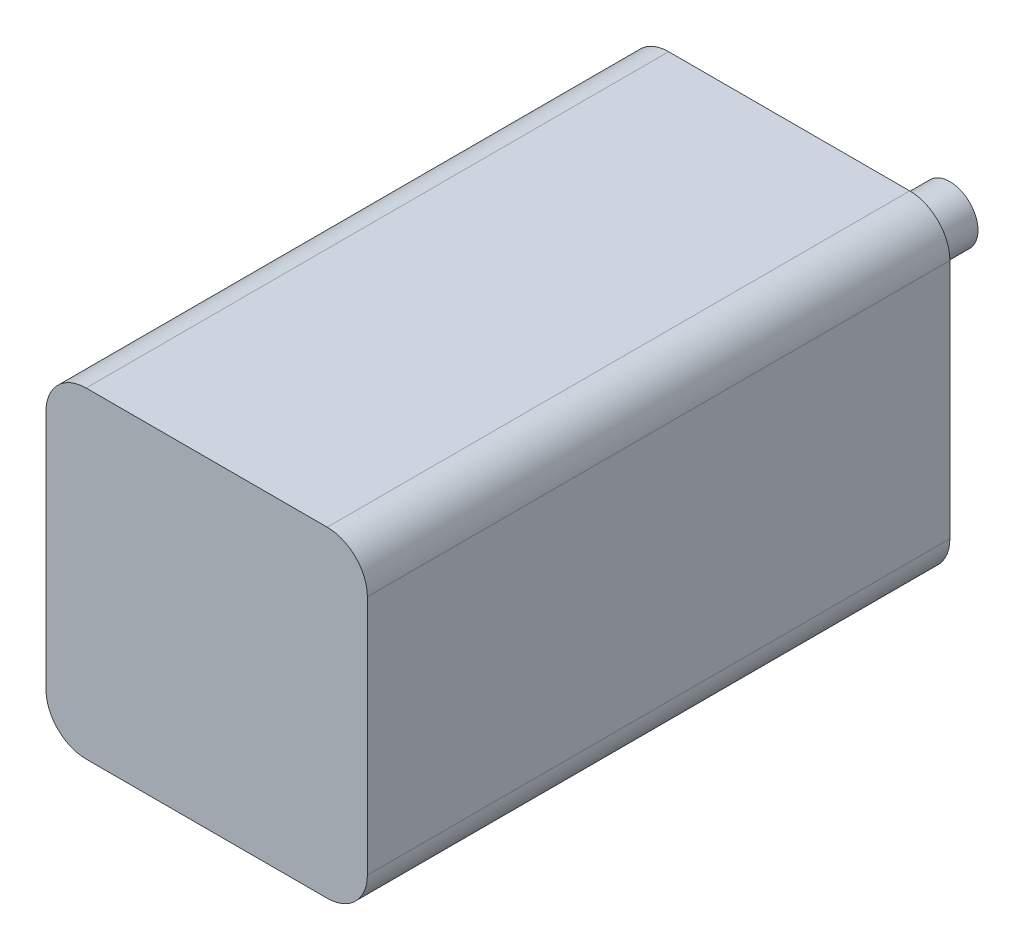
ISO-10303-21;
HEADER;
FILE_DESCRIPTION(('STEP AP214'),'2;1');
FILE_NAME('part.step','',(''),(''),'','','');
FILE_SCHEMA(('AUTOMOTIVE_DESIGN { 1 0 10303 214 1 1 1 1 }'));
ENDSEC;
DATA;
#1=APPLICATION_CONTEXT('core data for automotive mechanical design processes');
#2=APPLICATION_PROTOCOL_DEFINITION('international standard','automotive_design',2000,#1);
#3=PRODUCT_CONTEXT('',#1,'mechanical');
#4=PRODUCT('Part','Part','',(#3));
#5=PRODUCT_RELATED_PRODUCT_CATEGORY('part','',(#4));
#6=PRODUCT_DEFINITION_FORMATION('','',#4);
#7=PRODUCT_DEFINITION_CONTEXT('part definition',#1,'design');
#8=PRODUCT_DEFINITION('design','',#6,#7);
#9=PRODUCT_DEFINITION_SHAPE('','',#8);
#10=(LENGTH_UNIT() NAMED_UNIT(*) SI_UNIT(.MILLI.,.METRE.));
#11=(NAMED_UNIT(*) PLANE_ANGLE_UNIT() SI_UNIT($,.RADIAN.));
#12=(NAMED_UNIT(*) SI_UNIT($,.STERADIAN.) SOLID_ANGLE_UNIT());
#13=UNCERTAINTY_MEASURE_WITH_UNIT(LENGTH_MEASURE(1.E-05),#10,'distance_accuracy_value','');
#14=(GEOMETRIC_REPRESENTATION_CONTEXT(3) GLOBAL_UNCERTAINTY_ASSIGNED_CONTEXT((#13)) GLOBAL_UNIT_ASSIGNED_CONTEXT((#10,
#11,#12)) REPRESENTATION_CONTEXT('',''));
#15=CARTESIAN_POINT('',(0.,0.,0.));
#16=DIRECTION('',(0.,0.,1.));
#17=DIRECTION('',(1.,0.,0.));
#18=AXIS2_PLACEMENT_3D('',#15,#16,#17);
#19=CARTESIAN_POINT('',(-56.4847179465369,18.778947368421,145.));
#20=DIRECTION('',(1.,0.,0.));
#21=DIRECTION('',(0.,1.,0.));
#22=AXIS2_PLACEMENT_3D('',#19,#20,#21);
#23=PLANE('',#22);
#24=DIRECTION('',(0.,-1.,0.));
#25=VECTOR('',#24,1.);
#26=CARTESIAN_POINT('',(-56.4847179465369,18.778947368421,0.));
#27=LINE('',#26,#25);
#28=CARTESIAN_POINT('',(-56.4847179465369,8.77894736842103,0.));
#29=VERTEX_POINT('',#28);
#30=CARTESIAN_POINT('',(-56.4847179465369,-51.221052631579,0.));
#31=VERTEX_POINT('',#30);
#32=EDGE_CURVE('E131',#29,#31,#27,.T.);
#33=ORIENTED_EDGE('',*,*,#32,.T.);
#34=DIRECTION('',(0.,0.,-1.));
#35=VECTOR('',#34,1.);
#36=CARTESIAN_POINT('',(-56.4847179465369,-51.221052631579,145.));
#37=LINE('',#36,#35);
#38=CARTESIAN_POINT('',(-56.4847179465369,-51.221052631579,145.));
#39=VERTEX_POINT('',#38);
#40=EDGE_CURVE('E109',#31,#39,#37,.F.);
#41=ORIENTED_EDGE('',*,*,#40,.T.);
#42=DIRECTION('',(0.,-1.,0.));
#43=VECTOR('',#42,1.);
#44=CARTESIAN_POINT('',(-56.4847179465369,18.778947368421,145.));
#45=LINE('',#44,#43);
#46=CARTESIAN_POINT('',(-56.4847179465369,8.77894736842103,145.));
#47=VERTEX_POINT('',#46);
#48=EDGE_CURVE('E141',#47,#39,#45,.T.);
#49=ORIENTED_EDGE('',*,*,#48,.F.);
#50=DIRECTION('',(0.,0.,-1.));
#51=VECTOR('',#50,1.);
#52=CARTESIAN_POINT('',(-56.4847179465369,8.77894736842103,145.));
#53=LINE('',#52,#51);
#54=EDGE_CURVE('E114',#47,#29,#53,.T.);
#55=ORIENTED_EDGE('',*,*,#54,.T.);
#56=EDGE_LOOP('',(#33,#41,#49,#55));
#57=FACE_BOUND('',#56,.T.);
#58=ADVANCED_FACE('F38',(#57),#23,.F.);
#59=CARTESIAN_POINT('',(-56.4847179465369,-61.221052631579,145.));
#60=DIRECTION('',(0.,1.,0.));
#61=DIRECTION('',(0.,0.,1.));
#62=AXIS2_PLACEMENT_3D('',#59,#60,#61);
#63=PLANE('',#62);
#64=DIRECTION('',(1.,0.,0.));
#65=VECTOR('',#64,1.);
#66=CARTESIAN_POINT('',(-56.4847179465369,-61.221052631579,145.));
#67=LINE('',#66,#65);
#68=CARTESIAN_POINT('',(-46.4847179465369,-61.221052631579,145.));
#69=VERTEX_POINT('',#68);
#70=CARTESIAN_POINT('',(13.5152820534631,-61.221052631579,145.));
#71=VERTEX_POINT('',#70);
#72=EDGE_CURVE('E124',#69,#71,#67,.T.);
#73=ORIENTED_EDGE('',*,*,#72,.F.);
#74=DIRECTION('',(0.,0.,-1.));
#75=VECTOR('',#74,1.);
#76=CARTESIAN_POINT('',(-46.4847179465369,-61.221052631579,145.));
#77=LINE('',#76,#75);
#78=CARTESIAN_POINT('',(-46.4847179465369,-61.221052631579,0.));
#79=VERTEX_POINT('',#78);
#80=EDGE_CURVE('E108',#69,#79,#77,.T.);
#81=ORIENTED_EDGE('',*,*,#80,.T.);
#82=DIRECTION('',(1.,0.,0.));
#83=VECTOR('',#82,1.);
#84=CARTESIAN_POINT('',(-56.4847179465369,-61.221052631579,0.));
#85=LINE('',#84,#83);
#86=CARTESIAN_POINT('',(13.5152820534631,-61.221052631579,0.));
#87=VERTEX_POINT('',#86);
#88=EDGE_CURVE('E121',#79,#87,#85,.T.);
#89=ORIENTED_EDGE('',*,*,#88,.T.);
#90=DIRECTION('',(0.,0.,-1.));
#91=VECTOR('',#90,1.);
#92=CARTESIAN_POINT('',(13.5152820534631,-61.221052631579,145.));
#93=LINE('',#92,#91);
#94=EDGE_CURVE('E126',#87,#71,#93,.F.);
#95=ORIENTED_EDGE('',*,*,#94,.T.);
#96=EDGE_LOOP('',(#73,#81,#89,#95));
#97=FACE_BOUND('',#96,.T.);
#98=ADVANCED_FACE('F120',(#97),#63,.F.);
#99=CARTESIAN_POINT('',(23.5152820534631,18.778947368421,145.));
#100=DIRECTION('',(-1.,0.,0.));
#101=DIRECTION('',(0.,-1.,0.));
#102=AXIS2_PLACEMENT_3D('',#99,#100,#101);
#103=PLANE('',#102);
#104=DIRECTION('',(0.,1.,0.));
#105=VECTOR('',#104,1.);
#106=CARTESIAN_POINT('',(23.5152820534631,18.778947368421,145.));
#107=LINE('',#106,#105);
#108=CARTESIAN_POINT('',(23.5152820534631,-51.221052631579,145.));
#109=VERTEX_POINT('',#108);
#110=CARTESIAN_POINT('',(23.5152820534631,8.77894736842104,145.));
#111=VERTEX_POINT('',#110);
#112=EDGE_CURVE('E177',#109,#111,#107,.T.);
#113=ORIENTED_EDGE('',*,*,#112,.F.);
#114=DIRECTION('',(0.,0.,-1.));
#115=VECTOR('',#114,1.);
#116=CARTESIAN_POINT('',(23.5152820534631,-51.221052631579,145.));
#117=LINE('',#116,#115);
#118=CARTESIAN_POINT('',(23.5152820534631,-51.221052631579,0.));
#119=VERTEX_POINT('',#118);
#120=EDGE_CURVE('E160',#109,#119,#117,.T.);
#121=ORIENTED_EDGE('',*,*,#120,.T.);
#122=DIRECTION('',(0.,1.,0.));
#123=VECTOR('',#122,1.);
#124=CARTESIAN_POINT('',(23.5152820534631,18.778947368421,0.));
#125=LINE('',#124,#123);
#126=CARTESIAN_POINT('',(23.5152820534631,8.77894736842104,0.));
#127=VERTEX_POINT('',#126);
#128=EDGE_CURVE('E130',#119,#127,#125,.T.);
#129=ORIENTED_EDGE('',*,*,#128,.T.);
#130=DIRECTION('',(0.,0.,-1.));
#131=VECTOR('',#130,1.);
#132=CARTESIAN_POINT('',(23.5152820534631,8.77894736842104,145.));
#133=LINE('',#132,#131);
#134=EDGE_CURVE('E158',#127,#111,#133,.F.);
#135=ORIENTED_EDGE('',*,*,#134,.T.);
#136=EDGE_LOOP('',(#113,#121,#129,#135));
#137=FACE_BOUND('',#136,.T.);
#138=ADVANCED_FACE('F192',(#137),#103,.F.);
#139=CARTESIAN_POINT('',(-56.4847179465369,18.778947368421,145.));
#140=DIRECTION('',(0.,-1.,0.));
#141=DIRECTION('',(0.,0.,-1.));
#142=AXIS2_PLACEMENT_3D('',#139,#140,#141);
#143=PLANE('',#142);
#144=DIRECTION('',(-1.,0.,0.));
#145=VECTOR('',#144,1.);
#146=CARTESIAN_POINT('',(-56.4847179465369,18.778947368421,0.));
#147=LINE('',#146,#145);
#148=CARTESIAN_POINT('',(13.515282053463,18.778947368421,0.));
#149=VERTEX_POINT('',#148);
#150=CARTESIAN_POINT('',(-46.4847179465369,18.778947368421,0.));
#151=VERTEX_POINT('',#150);
#152=EDGE_CURVE('E134',#149,#151,#147,.T.);
#153=ORIENTED_EDGE('',*,*,#152,.T.);
#154=DIRECTION('',(0.,0.,-1.));
#155=VECTOR('',#154,1.);
#156=CARTESIAN_POINT('',(-46.4847179465369,18.778947368421,145.));
#157=LINE('',#156,#155);
#158=CARTESIAN_POINT('',(-46.4847179465369,18.778947368421,145.));
#159=VERTEX_POINT('',#158);
#160=EDGE_CURVE('E46',#151,#159,#157,.F.);
#161=ORIENTED_EDGE('',*,*,#160,.T.);
#162=DIRECTION('',(-1.,0.,0.));
#163=VECTOR('',#162,1.);
#164=CARTESIAN_POINT('',(-56.4847179465369,18.778947368421,145.));
#165=LINE('',#164,#163);
#166=CARTESIAN_POINT('',(13.515282053463,18.778947368421,145.));
#167=VERTEX_POINT('',#166);
#168=EDGE_CURVE('E142',#167,#159,#165,.T.);
#169=ORIENTED_EDGE('',*,*,#168,.F.);
#170=DIRECTION('',(0.,0.,-1.));
#171=VECTOR('',#170,1.);
#172=CARTESIAN_POINT('',(13.515282053463,18.778947368421,145.));
#173=LINE('',#172,#171);
#174=EDGE_CURVE('E163',#167,#149,#173,.T.);
#175=ORIENTED_EDGE('',*,*,#174,.T.);
#176=EDGE_LOOP('',(#153,#161,#169,#175));
#177=FACE_BOUND('',#176,.T.);
#178=ADVANCED_FACE('F167',(#177),#143,.F.);
#179=CARTESIAN_POINT('',(0.,0.,145.));
#180=DIRECTION('',(0.,0.,1.));
#181=DIRECTION('',(1.,0.,0.));
#182=AXIS2_PLACEMENT_3D('',#179,#180,#181);
#183=PLANE('',#182);
#184=ORIENTED_EDGE('',*,*,#48,.T.);
#185=CARTESIAN_POINT('',(-46.4847179465369,-51.221052631579,145.));
#186=DIRECTION('',(0.,0.,1.));
#187=DIRECTION('',(1.,0.,0.));
#188=AXIS2_PLACEMENT_3D('',#185,#186,#187);
#189=CIRCLE('',#188,10.);
#190=EDGE_CURVE('E156',#39,#69,#189,.T.);
#191=ORIENTED_EDGE('',*,*,#190,.T.);
#192=ORIENTED_EDGE('',*,*,#72,.T.);
#193=CARTESIAN_POINT('',(13.5152820534631,-51.221052631579,145.));
#194=DIRECTION('',(0.,0.,1.));
#195=DIRECTION('',(1.,0.,0.));
#196=AXIS2_PLACEMENT_3D('',#193,#194,#195);
#197=CIRCLE('',#196,10.);
#198=EDGE_CURVE('E154',#71,#109,#197,.T.);
#199=ORIENTED_EDGE('',*,*,#198,.T.);
#200=ORIENTED_EDGE('',*,*,#112,.T.);
#201=CARTESIAN_POINT('',(13.515282053463,8.77894736842104,145.));
#202=DIRECTION('',(0.,0.,1.));
#203=DIRECTION('',(1.,0.,0.));
#204=AXIS2_PLACEMENT_3D('',#201,#202,#203);
#205=CIRCLE('',#204,10.);
#206=EDGE_CURVE('E59',#111,#167,#205,.T.);
#207=ORIENTED_EDGE('',*,*,#206,.T.);
#208=ORIENTED_EDGE('',*,*,#168,.T.);
#209=CARTESIAN_POINT('',(-46.4847179465369,8.77894736842104,145.));
#210=DIRECTION('',(0.,0.,1.));
#211=DIRECTION('',(1.,0.,0.));
#212=AXIS2_PLACEMENT_3D('',#209,#210,#211);
#213=CIRCLE('',#212,10.);
#214=EDGE_CURVE('E152',#159,#47,#213,.T.);
#215=ORIENTED_EDGE('',*,*,#214,.T.);
#216=EDGE_LOOP('',(#184,#191,#192,#199,#200,#207,#208,#215));
#217=FACE_BOUND('',#216,.T.);
#218=ADVANCED_FACE('F182',(#217),#183,.T.);
#219=CARTESIAN_POINT('',(0.,0.,0.));
#220=DIRECTION('',(0.,0.,1.));
#221=DIRECTION('',(1.,0.,0.));
#222=AXIS2_PLACEMENT_3D('',#219,#220,#221);
#223=PLANE('',#222);
#224=CARTESIAN_POINT('',(9.76460291245903,-35.7558952396204,0.));
#225=DIRECTION('',(0.,0.,-1.));
#226=DIRECTION('',(0.500000000000004,0.866025403784436,0.));
#227=AXIS2_PLACEMENT_3D('',#224,#225,#226);
#228=CIRCLE('',#227,3.27136097651396);
#229=CARTESIAN_POINT('',(11.400283400716,-32.9228135290103,0.));
#230=VERTEX_POINT('',#229);
#231=EDGE_CURVE('E342',#230,#230,#228,.T.);
#232=ORIENTED_EDGE('',*,*,#231,.F.);
#233=EDGE_LOOP('',(#232));
#234=FACE_BOUND('',#233,.T.);
#235=CARTESIAN_POINT('',(-42.1969213146074,-36.6862100235374,0.));
#236=DIRECTION('',(0.,0.,-1.));
#237=DIRECTION('',(0.499999999999992,-0.866025403784443,0.));
#238=AXIS2_PLACEMENT_3D('',#235,#236,#237);
#239=CIRCLE('',#238,3.27136097651396);
#240=CARTESIAN_POINT('',(-40.5612408263504,-39.5192917341476,0.));
#241=VERTEX_POINT('',#240);
#242=EDGE_CURVE('E352',#241,#241,#239,.T.);
#243=ORIENTED_EDGE('',*,*,#242,.F.);
#244=EDGE_LOOP('',(#243));
#245=FACE_BOUND('',#244,.T.);
#246=CARTESIAN_POINT('',(-17.0218354374627,8.77894736842103,0.));
#247=DIRECTION('',(0.,0.,-1.));
#248=DIRECTION('',(-1.,0.,0.));
#249=AXIS2_PLACEMENT_3D('',#246,#247,#248);
#250=CIRCLE('',#249,3.27136097651396);
#251=CARTESIAN_POINT('',(-20.2931964139767,8.77894736842103,0.));
#252=VERTEX_POINT('',#251);
#253=EDGE_CURVE('E341',#252,#252,#250,.T.);
#254=ORIENTED_EDGE('',*,*,#253,.F.);
#255=EDGE_LOOP('',(#254));
#256=FACE_BOUND('',#255,.T.);
#257=CARTESIAN_POINT('',(-16.4847179465369,-21.221052631579,0.));
#258=DIRECTION('',(0.,0.,1.));
#259=DIRECTION('',(1.,0.,0.));
#260=AXIS2_PLACEMENT_3D('',#257,#258,#259);
#261=CIRCLE('',#260,7.);
#262=CARTESIAN_POINT('',(-9.48471794653695,-21.221052631579,0.));
#263=VERTEX_POINT('',#262);
#264=EDGE_CURVE('E11',#263,#263,#261,.F.);
#265=ORIENTED_EDGE('',*,*,#264,.F.);
#266=EDGE_LOOP('',(#265));
#267=FACE_BOUND('',#266,.T.);
#268=ORIENTED_EDGE('',*,*,#88,.F.);
#269=CARTESIAN_POINT('',(-46.4847179465369,-51.221052631579,0.));
#270=DIRECTION('',(0.,0.,1.));
#271=DIRECTION('',(1.,0.,0.));
#272=AXIS2_PLACEMENT_3D('',#269,#270,#271);
#273=CIRCLE('',#272,10.);
#274=EDGE_CURVE('E104',#79,#31,#273,.F.);
#275=ORIENTED_EDGE('',*,*,#274,.T.);
#276=ORIENTED_EDGE('',*,*,#32,.F.);
#277=CARTESIAN_POINT('',(-46.4847179465369,8.77894736842104,0.));
#278=DIRECTION('',(0.,0.,1.));
#279=DIRECTION('',(1.,0.,0.));
#280=AXIS2_PLACEMENT_3D('',#277,#278,#279);
#281=CIRCLE('',#280,10.);
#282=EDGE_CURVE('E145',#29,#151,#281,.F.);
#283=ORIENTED_EDGE('',*,*,#282,.T.);
#284=ORIENTED_EDGE('',*,*,#152,.F.);
#285=CARTESIAN_POINT('',(13.515282053463,8.77894736842104,0.));
#286=DIRECTION('',(0.,0.,1.));
#287=DIRECTION('',(1.,0.,0.));
#288=AXIS2_PLACEMENT_3D('',#285,#286,#287);
#289=CIRCLE('',#288,10.);
#290=EDGE_CURVE('E125',#149,#127,#289,.F.);
#291=ORIENTED_EDGE('',*,*,#290,.T.);
#292=ORIENTED_EDGE('',*,*,#128,.F.);
#293=CARTESIAN_POINT('',(13.5152820534631,-51.221052631579,0.));
#294=DIRECTION('',(0.,0.,1.));
#295=DIRECTION('',(1.,0.,0.));
#296=AXIS2_PLACEMENT_3D('',#293,#294,#295);
#297=CIRCLE('',#296,10.);
#298=EDGE_CURVE('E115',#119,#87,#297,.F.);
#299=ORIENTED_EDGE('',*,*,#298,.T.);
#300=EDGE_LOOP('',(#268,#275,#276,#283,#284,#291,#292,#299));
#301=FACE_BOUND('',#300,.T.);
#302=ADVANCED_FACE('F128',(#234,#245,#256,#267,#301),#223,.F.);
#303=CARTESIAN_POINT('',(-46.4847179465369,-51.221052631579,145.));
#304=DIRECTION('',(0.,0.,-1.));
#305=DIRECTION('',(-1.,0.,0.));
#306=AXIS2_PLACEMENT_3D('',#303,#304,#305);
#307=CYLINDRICAL_SURFACE('',#306,10.);
#308=ORIENTED_EDGE('',*,*,#190,.F.);
#309=ORIENTED_EDGE('',*,*,#40,.F.);
#310=ORIENTED_EDGE('',*,*,#274,.F.);
#311=ORIENTED_EDGE('',*,*,#80,.F.);
#312=EDGE_LOOP('',(#308,#309,#310,#311));
#313=FACE_BOUND('',#312,.T.);
#314=ADVANCED_FACE('F107',(#313),#307,.T.);
#315=CARTESIAN_POINT('',(13.5152820534631,-51.221052631579,145.));
#316=DIRECTION('',(0.,0.,-1.));
#317=DIRECTION('',(-1.,0.,0.));
#318=AXIS2_PLACEMENT_3D('',#315,#316,#317);
#319=CYLINDRICAL_SURFACE('',#318,10.);
#320=ORIENTED_EDGE('',*,*,#198,.F.);
#321=ORIENTED_EDGE('',*,*,#94,.F.);
#322=ORIENTED_EDGE('',*,*,#298,.F.);
#323=ORIENTED_EDGE('',*,*,#120,.F.);
#324=EDGE_LOOP('',(#320,#321,#322,#323));
#325=FACE_BOUND('',#324,.T.);
#326=ADVANCED_FACE('F205',(#325),#319,.T.);
#327=CARTESIAN_POINT('',(-46.4847179465369,8.77894736842104,145.));
#328=DIRECTION('',(0.,0.,-1.));
#329=DIRECTION('',(-1.,0.,0.));
#330=AXIS2_PLACEMENT_3D('',#327,#328,#329);
#331=CYLINDRICAL_SURFACE('',#330,10.);
#332=ORIENTED_EDGE('',*,*,#214,.F.);
#333=ORIENTED_EDGE('',*,*,#160,.F.);
#334=ORIENTED_EDGE('',*,*,#282,.F.);
#335=ORIENTED_EDGE('',*,*,#54,.F.);
#336=EDGE_LOOP('',(#332,#333,#334,#335));
#337=FACE_BOUND('',#336,.T.);
#338=ADVANCED_FACE('F172',(#337),#331,.T.);
#339=CARTESIAN_POINT('',(13.515282053463,8.77894736842104,145.));
#340=DIRECTION('',(0.,0.,-1.));
#341=DIRECTION('',(-1.,0.,0.));
#342=AXIS2_PLACEMENT_3D('',#339,#340,#341);
#343=CYLINDRICAL_SURFACE('',#342,10.);
#344=ORIENTED_EDGE('',*,*,#206,.F.);
#345=ORIENTED_EDGE('',*,*,#134,.F.);
#346=ORIENTED_EDGE('',*,*,#290,.F.);
#347=ORIENTED_EDGE('',*,*,#174,.F.);
#348=EDGE_LOOP('',(#344,#345,#346,#347));
#349=FACE_BOUND('',#348,.T.);
#350=ADVANCED_FACE('F40',(#349),#343,.T.);
#351=CARTESIAN_POINT('',(-16.4847179465369,-21.221052631579,-40.));
#352=DIRECTION('',(0.,0.,1.));
#353=DIRECTION('',(1.,0.,0.));
#354=AXIS2_PLACEMENT_3D('',#351,#352,#353);
#355=CYLINDRICAL_SURFACE('',#354,7.);
#356=CARTESIAN_POINT('',(-16.4847179465369,-21.221052631579,-40.));
#357=DIRECTION('',(0.,0.,-1.));
#358=DIRECTION('',(-1.,0.,0.));
#359=AXIS2_PLACEMENT_3D('',#356,#357,#358);
#360=CIRCLE('',#359,7.);
#361=CARTESIAN_POINT('',(-23.4847179465369,-21.221052631579,-40.));
#362=VERTEX_POINT('',#361);
#363=EDGE_CURVE('E136',#362,#362,#360,.T.);
#364=ORIENTED_EDGE('',*,*,#363,.F.);
#365=EDGE_LOOP('',(#364));
#366=FACE_BOUND('',#365,.T.);
#367=ORIENTED_EDGE('',*,*,#264,.T.);
#368=EDGE_LOOP('',(#367));
#369=FACE_BOUND('',#368,.T.);
#370=ADVANCED_FACE('F212',(#366,#369),#355,.T.);
#371=CARTESIAN_POINT('',(-16.4847179465369,-21.221052631579,-40.));
#372=DIRECTION('',(0.,0.,-1.));
#373=DIRECTION('',(-1.,0.,0.));
#374=AXIS2_PLACEMENT_3D('',#371,#372,#373);
#375=PLANE('',#374);
#376=ORIENTED_EDGE('',*,*,#363,.T.);
#377=EDGE_LOOP('',(#376));
#378=FACE_BOUND('',#377,.T.);
#379=ADVANCED_FACE('F216',(#378),#375,.T.);
#380=CARTESIAN_POINT('',(-17.0218354374627,8.77894736842103,10.));
#381=DIRECTION('',(0.,0.,-1.));
#382=DIRECTION('',(-1.,0.,0.));
#383=AXIS2_PLACEMENT_3D('',#380,#381,#382);
#384=CYLINDRICAL_SURFACE('',#383,3.27136097651396);
#385=CARTESIAN_POINT('',(-17.0218354374627,8.77894736842103,10.));
#386=DIRECTION('',(0.,0.,-1.));
#387=DIRECTION('',(-1.,0.,0.));
#388=AXIS2_PLACEMENT_3D('',#385,#386,#387);
#389=CIRCLE('',#388,3.27136097651396);
#390=CARTESIAN_POINT('',(-20.2931964139767,8.77894736842103,10.));
#391=VERTEX_POINT('',#390);
#392=EDGE_CURVE('E345',#391,#391,#389,.T.);
#393=ORIENTED_EDGE('',*,*,#392,.F.);
#394=EDGE_LOOP('',(#393));
#395=FACE_BOUND('',#394,.T.);
#396=ORIENTED_EDGE('',*,*,#253,.T.);
#397=EDGE_LOOP('',(#396));
#398=FACE_BOUND('',#397,.T.);
#399=ADVANCED_FACE('F272',(#395,#398),#384,.F.);
#400=CARTESIAN_POINT('',(-17.0218354374627,8.77894736842103,10.));
#401=DIRECTION('',(0.,0.,-1.));
#402=DIRECTION('',(-1.,0.,0.));
#403=AXIS2_PLACEMENT_3D('',#400,#401,#402);
#404=PLANE('',#403);
#405=ORIENTED_EDGE('',*,*,#392,.T.);
#406=EDGE_LOOP('',(#405));
#407=FACE_BOUND('',#406,.T.);
#408=ADVANCED_FACE('F282',(#407),#404,.T.);
#409=CARTESIAN_POINT('',(-42.1969213146074,-36.6862100235374,10.));
#410=DIRECTION('',(0.,0.,-1.));
#411=DIRECTION('',(-1.,0.,0.));
#412=AXIS2_PLACEMENT_3D('',#409,#410,#411);
#413=CYLINDRICAL_SURFACE('',#412,3.27136097651396);
#414=CARTESIAN_POINT('',(-42.1969213146074,-36.6862100235374,10.));
#415=DIRECTION('',(0.,0.,-1.));
#416=DIRECTION('',(0.499999999999992,-0.866025403784443,0.));
#417=AXIS2_PLACEMENT_3D('',#414,#415,#416);
#418=CIRCLE('',#417,3.27136097651396);
#419=CARTESIAN_POINT('',(-40.5612408263504,-39.5192917341476,10.));
#420=VERTEX_POINT('',#419);
#421=EDGE_CURVE('E347',#420,#420,#418,.T.);
#422=ORIENTED_EDGE('',*,*,#421,.F.);
#423=EDGE_LOOP('',(#422));
#424=FACE_BOUND('',#423,.T.);
#425=ORIENTED_EDGE('',*,*,#242,.T.);
#426=EDGE_LOOP('',(#425));
#427=FACE_BOUND('',#426,.T.);
#428=ADVANCED_FACE('F291',(#424,#427),#413,.F.);
#429=CARTESIAN_POINT('',(-42.1969213146074,-36.6862100235374,10.));
#430=DIRECTION('',(0.,0.,-1.));
#431=DIRECTION('',(0.499999999999992,-0.866025403784443,0.));
#432=AXIS2_PLACEMENT_3D('',#429,#430,#431);
#433=PLANE('',#432);
#434=ORIENTED_EDGE('',*,*,#421,.T.);
#435=EDGE_LOOP('',(#434));
#436=FACE_BOUND('',#435,.T.);
#437=ADVANCED_FACE('F304',(#436),#433,.T.);
#438=CARTESIAN_POINT('',(9.76460291245903,-35.7558952396204,10.));
#439=DIRECTION('',(0.,0.,-1.));
#440=DIRECTION('',(-1.,0.,0.));
#441=AXIS2_PLACEMENT_3D('',#438,#439,#440);
#442=CYLINDRICAL_SURFACE('',#441,3.27136097651396);
#443=CARTESIAN_POINT('',(9.76460291245903,-35.7558952396204,10.));
#444=DIRECTION('',(0.,0.,-1.));
#445=DIRECTION('',(0.500000000000004,0.866025403784436,0.));
#446=AXIS2_PLACEMENT_3D('',#443,#444,#445);
#447=CIRCLE('',#446,3.27136097651396);
#448=CARTESIAN_POINT('',(11.400283400716,-32.9228135290103,10.));
#449=VERTEX_POINT('',#448);
#450=EDGE_CURVE('E340',#449,#449,#447,.T.);
#451=ORIENTED_EDGE('',*,*,#450,.F.);
#452=EDGE_LOOP('',(#451));
#453=FACE_BOUND('',#452,.T.);
#454=ORIENTED_EDGE('',*,*,#231,.T.);
#455=EDGE_LOOP('',(#454));
#456=FACE_BOUND('',#455,.T.);
#457=ADVANCED_FACE('F314',(#453,#456),#442,.F.);
#458=CARTESIAN_POINT('',(9.76460291245903,-35.7558952396204,10.));
#459=DIRECTION('',(0.,0.,-1.));
#460=DIRECTION('',(0.500000000000004,0.866025403784436,0.));
#461=AXIS2_PLACEMENT_3D('',#458,#459,#460);
#462=PLANE('',#461);
#463=ORIENTED_EDGE('',*,*,#450,.T.);
#464=EDGE_LOOP('',(#463));
#465=FACE_BOUND('',#464,.T.);
#466=ADVANCED_FACE('F324',(#465),#462,.T.);
#467=CLOSED_SHELL('',(#58,#98,#138,#178,#218,#302,#314,#326,#338,#350,#370,#379,#399,#408,#428,
#437,#457,#466));
#468=MANIFOLD_SOLID_BREP('B2',#467);
#469=ADVANCED_BREP_SHAPE_REPRESENTATION('',(#18,#468),#14);
#470=SHAPE_DEFINITION_REPRESENTATION(#9,#469);
ENDSEC;
END-ISO-10303-21;
